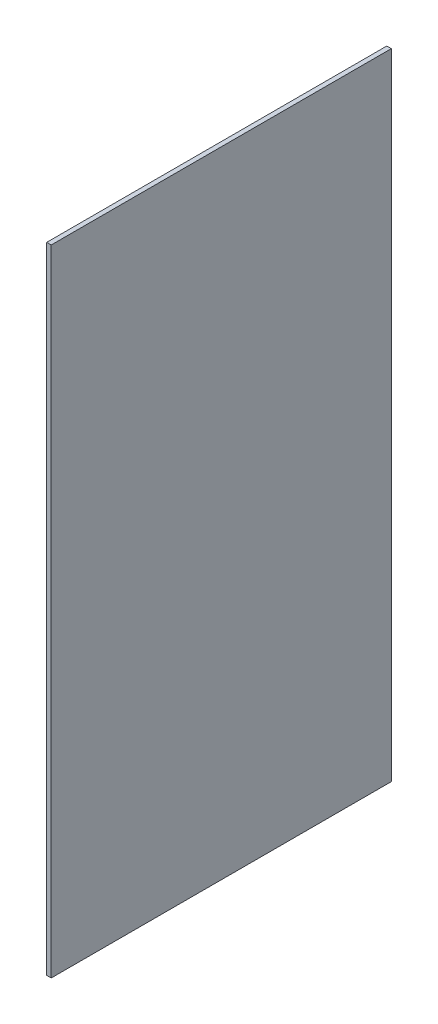
ISO-10303-21;
HEADER;
FILE_DESCRIPTION(('STEP AP214'),'2;1');
FILE_NAME('part.step','',(''),(''),'','','');
FILE_SCHEMA(('AUTOMOTIVE_DESIGN { 1 0 10303 214 1 1 1 1 }'));
ENDSEC;
DATA;
#1=APPLICATION_CONTEXT('core data for automotive mechanical design processes');
#2=APPLICATION_PROTOCOL_DEFINITION('international standard','automotive_design',2000,#1);
#3=PRODUCT_CONTEXT('',#1,'mechanical');
#4=PRODUCT('Part','Part','',(#3));
#5=PRODUCT_RELATED_PRODUCT_CATEGORY('part','',(#4));
#6=PRODUCT_DEFINITION_FORMATION('','',#4);
#7=PRODUCT_DEFINITION_CONTEXT('part definition',#1,'design');
#8=PRODUCT_DEFINITION('design','',#6,#7);
#9=PRODUCT_DEFINITION_SHAPE('','',#8);
#10=(LENGTH_UNIT() NAMED_UNIT(*) SI_UNIT(.MILLI.,.METRE.));
#11=(NAMED_UNIT(*) PLANE_ANGLE_UNIT() SI_UNIT($,.RADIAN.));
#12=(NAMED_UNIT(*) SI_UNIT($,.STERADIAN.) SOLID_ANGLE_UNIT());
#13=UNCERTAINTY_MEASURE_WITH_UNIT(LENGTH_MEASURE(1.E-05),#10,'distance_accuracy_value','');
#14=(GEOMETRIC_REPRESENTATION_CONTEXT(3) GLOBAL_UNCERTAINTY_ASSIGNED_CONTEXT((#13)) GLOBAL_UNIT_ASSIGNED_CONTEXT((#10,
#11,#12)) REPRESENTATION_CONTEXT('',''));
#15=CARTESIAN_POINT('',(0.,0.,0.));
#16=DIRECTION('',(0.,0.,1.));
#17=DIRECTION('',(1.,0.,0.));
#18=AXIS2_PLACEMENT_3D('',#15,#16,#17);
#19=CARTESIAN_POINT('',(0.4,-28.,15.));
#20=DIRECTION('',(0.,0.,-1.));
#21=DIRECTION('',(-1.,0.,0.));
#22=AXIS2_PLACEMENT_3D('',#19,#20,#21);
#23=PLANE('',#22);
#24=DIRECTION('',(0.,-1.,0.));
#25=VECTOR('',#24,1.);
#26=CARTESIAN_POINT('',(0.,-28.,15.));
#27=LINE('',#26,#25);
#28=CARTESIAN_POINT('',(0.,28.,15.));
#29=VERTEX_POINT('',#28);
#30=CARTESIAN_POINT('',(0.,-28.,15.));
#31=VERTEX_POINT('',#30);
#32=EDGE_CURVE('E113',#29,#31,#27,.T.);
#33=ORIENTED_EDGE('',*,*,#32,.T.);
#34=DIRECTION('',(-1.,0.,0.));
#35=VECTOR('',#34,1.);
#36=CARTESIAN_POINT('',(0.4,-28.,15.));
#37=LINE('',#36,#35);
#38=CARTESIAN_POINT('',(0.4,-28.,15.));
#39=VERTEX_POINT('',#38);
#40=EDGE_CURVE('E11',#39,#31,#37,.T.);
#41=ORIENTED_EDGE('',*,*,#40,.F.);
#42=DIRECTION('',(0.,-1.,0.));
#43=VECTOR('',#42,1.);
#44=CARTESIAN_POINT('',(0.4,-28.,15.));
#45=LINE('',#44,#43);
#46=CARTESIAN_POINT('',(0.4,28.,15.));
#47=VERTEX_POINT('',#46);
#48=EDGE_CURVE('E97',#47,#39,#45,.T.);
#49=ORIENTED_EDGE('',*,*,#48,.F.);
#50=DIRECTION('',(-1.,0.,0.));
#51=VECTOR('',#50,1.);
#52=CARTESIAN_POINT('',(0.4,28.,15.));
#53=LINE('',#52,#51);
#54=EDGE_CURVE('E109',#47,#29,#53,.T.);
#55=ORIENTED_EDGE('',*,*,#54,.T.);
#56=EDGE_LOOP('',(#33,#41,#49,#55));
#57=FACE_BOUND('',#56,.T.);
#58=ADVANCED_FACE('F45',(#57),#23,.F.);
#59=CARTESIAN_POINT('',(0.4,-28.,-15.));
#60=DIRECTION('',(0.,1.,0.));
#61=DIRECTION('',(0.,0.,1.));
#62=AXIS2_PLACEMENT_3D('',#59,#60,#61);
#63=PLANE('',#62);
#64=DIRECTION('',(0.,0.,-1.));
#65=VECTOR('',#64,1.);
#66=CARTESIAN_POINT('',(0.,-28.,-15.));
#67=LINE('',#66,#65);
#68=CARTESIAN_POINT('',(0.,-28.,-15.));
#69=VERTEX_POINT('',#68);
#70=EDGE_CURVE('E102',#31,#69,#67,.T.);
#71=ORIENTED_EDGE('',*,*,#70,.T.);
#72=DIRECTION('',(-1.,0.,0.));
#73=VECTOR('',#72,1.);
#74=CARTESIAN_POINT('',(0.4,-28.,-15.));
#75=LINE('',#74,#73);
#76=CARTESIAN_POINT('',(0.4,-28.,-15.));
#77=VERTEX_POINT('',#76);
#78=EDGE_CURVE('E54',#77,#69,#75,.T.);
#79=ORIENTED_EDGE('',*,*,#78,.F.);
#80=DIRECTION('',(0.,0.,-1.));
#81=VECTOR('',#80,1.);
#82=CARTESIAN_POINT('',(0.4,-28.,-15.));
#83=LINE('',#82,#81);
#84=EDGE_CURVE('E92',#39,#77,#83,.T.);
#85=ORIENTED_EDGE('',*,*,#84,.F.);
#86=ORIENTED_EDGE('',*,*,#40,.T.);
#87=EDGE_LOOP('',(#71,#79,#85,#86));
#88=FACE_BOUND('',#87,.T.);
#89=ADVANCED_FACE('F101',(#88),#63,.F.);
#90=CARTESIAN_POINT('',(0.4,-28.,-15.));
#91=DIRECTION('',(0.,0.,1.));
#92=DIRECTION('',(1.,0.,0.));
#93=AXIS2_PLACEMENT_3D('',#90,#91,#92);
#94=PLANE('',#93);
#95=DIRECTION('',(0.,1.,0.));
#96=VECTOR('',#95,1.);
#97=CARTESIAN_POINT('',(0.,-28.,-15.));
#98=LINE('',#97,#96);
#99=CARTESIAN_POINT('',(0.,28.,-15.));
#100=VERTEX_POINT('',#99);
#101=EDGE_CURVE('E79',#69,#100,#98,.T.);
#102=ORIENTED_EDGE('',*,*,#101,.T.);
#103=DIRECTION('',(-1.,0.,0.));
#104=VECTOR('',#103,1.);
#105=CARTESIAN_POINT('',(0.4,28.,-15.));
#106=LINE('',#105,#104);
#107=CARTESIAN_POINT('',(0.4,28.,-15.));
#108=VERTEX_POINT('',#107);
#109=EDGE_CURVE('E104',#108,#100,#106,.T.);
#110=ORIENTED_EDGE('',*,*,#109,.F.);
#111=DIRECTION('',(0.,1.,0.));
#112=VECTOR('',#111,1.);
#113=CARTESIAN_POINT('',(0.4,-28.,-15.));
#114=LINE('',#113,#112);
#115=EDGE_CURVE('E95',#77,#108,#114,.T.);
#116=ORIENTED_EDGE('',*,*,#115,.F.);
#117=ORIENTED_EDGE('',*,*,#78,.T.);
#118=EDGE_LOOP('',(#102,#110,#116,#117));
#119=FACE_BOUND('',#118,.T.);
#120=ADVANCED_FACE('F105',(#119),#94,.F.);
#121=CARTESIAN_POINT('',(0.4,28.,-15.));
#122=DIRECTION('',(0.,-1.,0.));
#123=DIRECTION('',(0.,0.,-1.));
#124=AXIS2_PLACEMENT_3D('',#121,#122,#123);
#125=PLANE('',#124);
#126=DIRECTION('',(0.,0.,1.));
#127=VECTOR('',#126,1.);
#128=CARTESIAN_POINT('',(0.,28.,-15.));
#129=LINE('',#128,#127);
#130=EDGE_CURVE('E85',#100,#29,#129,.T.);
#131=ORIENTED_EDGE('',*,*,#130,.T.);
#132=ORIENTED_EDGE('',*,*,#54,.F.);
#133=DIRECTION('',(0.,0.,1.));
#134=VECTOR('',#133,1.);
#135=CARTESIAN_POINT('',(0.4,28.,-15.));
#136=LINE('',#135,#134);
#137=EDGE_CURVE('E62',#108,#47,#136,.T.);
#138=ORIENTED_EDGE('',*,*,#137,.F.);
#139=ORIENTED_EDGE('',*,*,#109,.T.);
#140=EDGE_LOOP('',(#131,#132,#138,#139));
#141=FACE_BOUND('',#140,.T.);
#142=ADVANCED_FACE('F126',(#141),#125,.F.);
#143=CARTESIAN_POINT('',(0.4,0.,0.));
#144=DIRECTION('',(1.,0.,0.));
#145=DIRECTION('',(0.,0.,-1.));
#146=AXIS2_PLACEMENT_3D('',#143,#144,#145);
#147=PLANE('',#146);
#148=ORIENTED_EDGE('',*,*,#48,.T.);
#149=ORIENTED_EDGE('',*,*,#84,.T.);
#150=ORIENTED_EDGE('',*,*,#115,.T.);
#151=ORIENTED_EDGE('',*,*,#137,.T.);
#152=EDGE_LOOP('',(#148,#149,#150,#151));
#153=FACE_BOUND('',#152,.T.);
#154=ADVANCED_FACE('F93',(#153),#147,.T.);
#155=CARTESIAN_POINT('',(0.,0.,0.));
#156=DIRECTION('',(1.,0.,0.));
#157=DIRECTION('',(0.,0.,-1.));
#158=AXIS2_PLACEMENT_3D('',#155,#156,#157);
#159=PLANE('',#158);
#160=ORIENTED_EDGE('',*,*,#32,.F.);
#161=ORIENTED_EDGE('',*,*,#130,.F.);
#162=ORIENTED_EDGE('',*,*,#101,.F.);
#163=ORIENTED_EDGE('',*,*,#70,.F.);
#164=EDGE_LOOP('',(#160,#161,#162,#163));
#165=FACE_BOUND('',#164,.T.);
#166=ADVANCED_FACE('F129',(#165),#159,.F.);
#167=CLOSED_SHELL('',(#58,#89,#120,#142,#154,#166));
#168=MANIFOLD_SOLID_BREP('B2',#167);
#169=ADVANCED_BREP_SHAPE_REPRESENTATION('',(#18,#168),#14);
#170=SHAPE_DEFINITION_REPRESENTATION(#9,#169);
ENDSEC;
END-ISO-10303-21;
